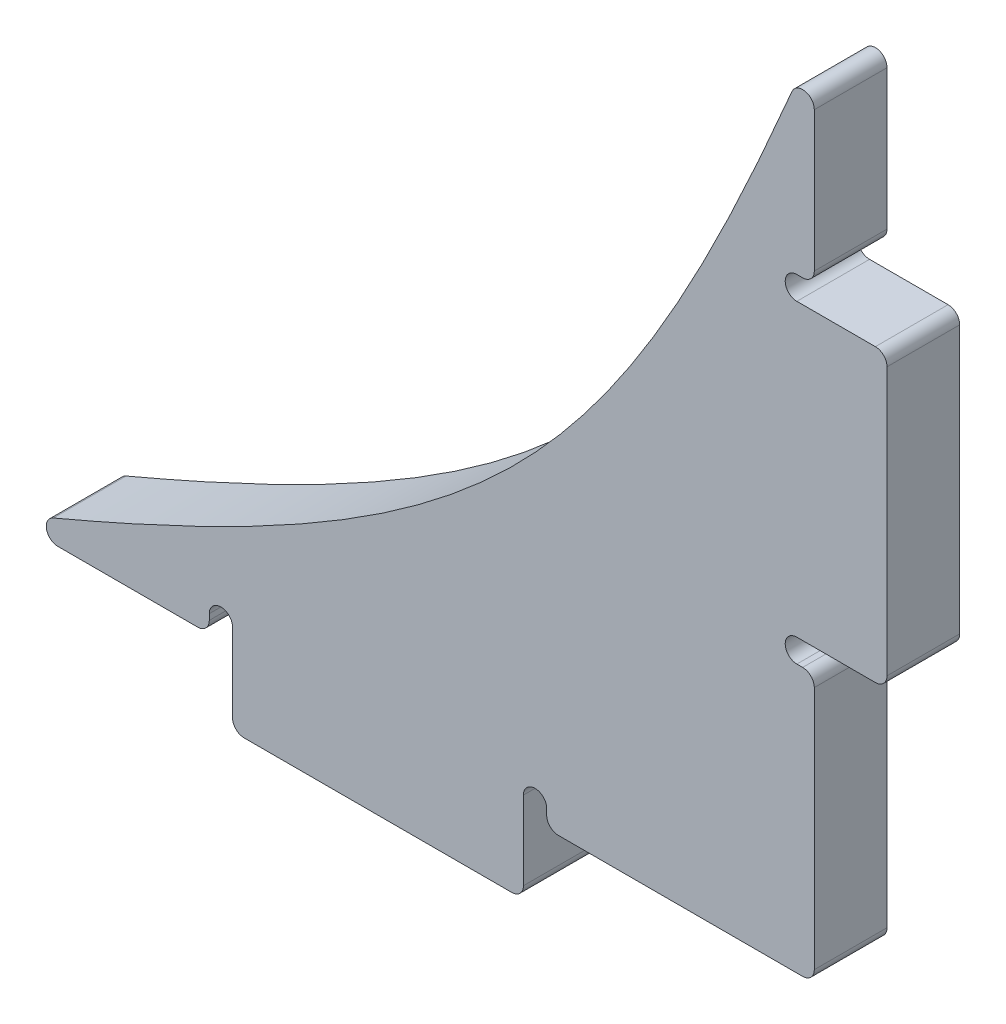
ISO-10303-21;
HEADER;
FILE_DESCRIPTION(('STEP AP214'),'2;1');
FILE_NAME('part.step','',(''),(''),'','','');
FILE_SCHEMA(('AUTOMOTIVE_DESIGN { 1 0 10303 214 1 1 1 1 }'));
ENDSEC;
DATA;
#1=APPLICATION_CONTEXT('core data for automotive mechanical design processes');
#2=APPLICATION_PROTOCOL_DEFINITION('international standard','automotive_design',2000,#1);
#3=PRODUCT_CONTEXT('',#1,'mechanical');
#4=PRODUCT('Part','Part','',(#3));
#5=PRODUCT_RELATED_PRODUCT_CATEGORY('part','',(#4));
#6=PRODUCT_DEFINITION_FORMATION('','',#4);
#7=PRODUCT_DEFINITION_CONTEXT('part definition',#1,'design');
#8=PRODUCT_DEFINITION('design','',#6,#7);
#9=PRODUCT_DEFINITION_SHAPE('','',#8);
#10=(LENGTH_UNIT() NAMED_UNIT(*) SI_UNIT(.MILLI.,.METRE.));
#11=(NAMED_UNIT(*) PLANE_ANGLE_UNIT() SI_UNIT($,.RADIAN.));
#12=(NAMED_UNIT(*) SI_UNIT($,.STERADIAN.) SOLID_ANGLE_UNIT());
#13=UNCERTAINTY_MEASURE_WITH_UNIT(LENGTH_MEASURE(1.E-05),#10,'distance_accuracy_value','');
#14=(GEOMETRIC_REPRESENTATION_CONTEXT(3) GLOBAL_UNCERTAINTY_ASSIGNED_CONTEXT((#13)) GLOBAL_UNIT_ASSIGNED_CONTEXT((#10,
#11,#12)) REPRESENTATION_CONTEXT('',''));
#15=CARTESIAN_POINT('',(0.,0.,0.));
#16=DIRECTION('',(0.,0.,1.));
#17=DIRECTION('',(1.,0.,0.));
#18=AXIS2_PLACEMENT_3D('',#15,#16,#17);
#19=CARTESIAN_POINT('',(16.6195398425815,-6.45990638103132,2.143125));
#20=DIRECTION('',(-1.,0.,0.));
#21=DIRECTION('',(0.,0.,1.));
#22=AXIS2_PLACEMENT_3D('',#19,#20,#21);
#23=PLANE('',#22);
#24=DIRECTION('',(0.,1.,0.));
#25=VECTOR('',#24,1.);
#26=CARTESIAN_POINT('',(16.6195398425815,-6.45990638103132,1.031875));
#27=LINE('',#26,#25);
#28=CARTESIAN_POINT('',(16.6195398425815,2.96349361896868,1.031875));
#29=VERTEX_POINT('',#28);
#30=CARTESIAN_POINT('',(16.6195398425815,5.09915083060559,1.031875));
#31=VERTEX_POINT('',#30);
#32=EDGE_CURVE('E377',#29,#31,#27,.T.);
#33=ORIENTED_EDGE('',*,*,#32,.T.);
#34=DIRECTION('',(0.,0.,-1.));
#35=VECTOR('',#34,1.);
#36=CARTESIAN_POINT('',(16.6195398425815,5.09915083060559,2.143125));
#37=LINE('',#36,#35);
#38=CARTESIAN_POINT('',(16.6195398425815,5.09915083060559,2.143125));
#39=VERTEX_POINT('',#38);
#40=EDGE_CURVE('E492',#31,#39,#37,.F.);
#41=ORIENTED_EDGE('',*,*,#40,.T.);
#42=DIRECTION('',(0.,1.,0.));
#43=VECTOR('',#42,1.);
#44=CARTESIAN_POINT('',(16.6195398425815,-6.45990638103132,2.143125));
#45=LINE('',#44,#43);
#46=CARTESIAN_POINT('',(16.6195398425815,2.96349361896868,2.143125));
#47=VERTEX_POINT('',#46);
#48=EDGE_CURVE('E383',#47,#39,#45,.T.);
#49=ORIENTED_EDGE('',*,*,#48,.F.);
#50=DIRECTION('',(0.,0.,1.));
#51=VECTOR('',#50,1.);
#52=CARTESIAN_POINT('',(16.6195398425815,2.96349361896868,2.143125));
#53=LINE('',#52,#51);
#54=EDGE_CURVE('E489',#47,#29,#53,.F.);
#55=ORIENTED_EDGE('',*,*,#54,.T.);
#56=EDGE_LOOP('',(#33,#41,#49,#55));
#57=FACE_BOUND('',#56,.T.);
#58=ADVANCED_FACE('F38',(#57),#23,.F.);
#59=CARTESIAN_POINT('',(16.6195398425815,-6.28210638103132,1.031875));
#60=VERTEX_POINT('',#59);
#61=CARTESIAN_POINT('',(16.6195398425815,-2.54830638103132,1.031875));
#62=VERTEX_POINT('',#61);
#63=EDGE_CURVE('E607',#60,#62,#27,.T.);
#64=ORIENTED_EDGE('',*,*,#63,.T.);
#65=DIRECTION('',(0.,0.,1.));
#66=VECTOR('',#65,1.);
#67=CARTESIAN_POINT('',(16.6195398425815,-2.54830638103132,2.143125));
#68=LINE('',#67,#66);
#69=CARTESIAN_POINT('',(16.6195398425815,-2.54830638103132,2.143125));
#70=VERTEX_POINT('',#69);
#71=EDGE_CURVE('E549',#62,#70,#68,.T.);
#72=ORIENTED_EDGE('',*,*,#71,.T.);
#73=CARTESIAN_POINT('',(16.6195398425815,-6.28210638103132,2.143125));
#74=VERTEX_POINT('',#73);
#75=EDGE_CURVE('E378',#74,#70,#45,.T.);
#76=ORIENTED_EDGE('',*,*,#75,.F.);
#77=DIRECTION('',(0.,0.,-1.));
#78=VECTOR('',#77,1.);
#79=CARTESIAN_POINT('',(16.6195398425815,-6.28210638103132,2.143125));
#80=LINE('',#79,#78);
#81=EDGE_CURVE('E545',#74,#60,#80,.T.);
#82=ORIENTED_EDGE('',*,*,#81,.T.);
#83=EDGE_LOOP('',(#64,#72,#76,#82));
#84=FACE_BOUND('',#83,.T.);
#85=ADVANCED_FACE('F408',(#84),#23,.F.);
#86=CARTESIAN_POINT('',(16.6195398425815,-6.45990638103132,2.143125));
#87=DIRECTION('',(0.,1.,0.));
#88=DIRECTION('',(-1.,0.,0.));
#89=AXIS2_PLACEMENT_3D('',#86,#87,#88);
#90=PLANE('',#89);
#91=DIRECTION('',(1.,0.,0.));
#92=VECTOR('',#91,1.);
#93=CARTESIAN_POINT('',(16.6195398425815,-6.45990638103132,1.031875));
#94=LINE('',#93,#92);
#95=CARTESIAN_POINT('',(5.06048263094462,-6.45990638103132,1.031875));
#96=VERTEX_POINT('',#95);
#97=CARTESIAN_POINT('',(7.19613984258153,-6.45990638103132,1.031875));
#98=VERTEX_POINT('',#97);
#99=EDGE_CURVE('E587',#96,#98,#94,.T.);
#100=ORIENTED_EDGE('',*,*,#99,.T.);
#101=DIRECTION('',(0.,0.,1.));
#102=VECTOR('',#101,1.);
#103=CARTESIAN_POINT('',(7.19613984258153,-6.45990638103132,2.143125));
#104=LINE('',#103,#102);
#105=CARTESIAN_POINT('',(7.19613984258153,-6.45990638103132,2.143125));
#106=VERTEX_POINT('',#105);
#107=EDGE_CURVE('E47',#98,#106,#104,.T.);
#108=ORIENTED_EDGE('',*,*,#107,.T.);
#109=DIRECTION('',(1.,0.,0.));
#110=VECTOR('',#109,1.);
#111=CARTESIAN_POINT('',(16.6195398425815,-6.45990638103132,2.143125));
#112=LINE('',#111,#110);
#113=CARTESIAN_POINT('',(5.06048263094462,-6.45990638103132,2.143125));
#114=VERTEX_POINT('',#113);
#115=EDGE_CURVE('E391',#114,#106,#112,.T.);
#116=ORIENTED_EDGE('',*,*,#115,.F.);
#117=DIRECTION('',(0.,0.,-1.));
#118=VECTOR('',#117,1.);
#119=CARTESIAN_POINT('',(5.06048263094462,-6.45990638103132,2.143125));
#120=LINE('',#119,#118);
#121=EDGE_CURVE('E580',#114,#96,#120,.T.);
#122=ORIENTED_EDGE('',*,*,#121,.T.);
#123=EDGE_LOOP('',(#100,#108,#116,#122));
#124=FACE_BOUND('',#123,.T.);
#125=ADVANCED_FACE('F404',(#124),#90,.F.);
#126=CARTESIAN_POINT('',(12.7079398425815,-6.45990638103132,1.031875));
#127=VERTEX_POINT('',#126);
#128=CARTESIAN_POINT('',(16.4417398425815,-6.45990638103132,1.031875));
#129=VERTEX_POINT('',#128);
#130=EDGE_CURVE('E618',#127,#129,#94,.T.);
#131=ORIENTED_EDGE('',*,*,#130,.T.);
#132=DIRECTION('',(0.,0.,-1.));
#133=VECTOR('',#132,1.);
#134=CARTESIAN_POINT('',(16.4417398425815,-6.45990638103132,2.143125));
#135=LINE('',#134,#133);
#136=CARTESIAN_POINT('',(16.4417398425815,-6.45990638103132,2.143125));
#137=VERTEX_POINT('',#136);
#138=EDGE_CURVE('E559',#129,#137,#135,.F.);
#139=ORIENTED_EDGE('',*,*,#138,.T.);
#140=CARTESIAN_POINT('',(12.7079398425815,-6.45990638103132,2.143125));
#141=VERTEX_POINT('',#140);
#142=EDGE_CURVE('E390',#141,#137,#112,.T.);
#143=ORIENTED_EDGE('',*,*,#142,.F.);
#144=DIRECTION('',(0.,0.,1.));
#145=VECTOR('',#144,1.);
#146=CARTESIAN_POINT('',(12.7079398425815,-6.45990638103132,2.143125));
#147=LINE('',#146,#145);
#148=EDGE_CURVE('E556',#141,#127,#147,.F.);
#149=ORIENTED_EDGE('',*,*,#148,.T.);
#150=EDGE_LOOP('',(#131,#139,#143,#149));
#151=FACE_BOUND('',#150,.T.);
#152=ADVANCED_FACE('F402',(#151),#90,.F.);
#153=CARTESIAN_POINT('',(16.6195398425815,5.98609361896868,2.143125));
#154=CARTESIAN_POINT('',(13.5396294849557,-1.494142237981,2.143125));
#155=CARTESIAN_POINT('',(11.6537756995312,-3.37999602340552,2.143125));
#156=CARTESIAN_POINT('',(4.17353984258153,-6.45990638103132,2.143125));
#157=B_SPLINE_CURVE_WITH_KNOTS('',3,(#153,#154,#155,#156),.UNSPECIFIED.,.F.,.F.,(4,4),(0.,1.),.UNSPECIFIED.);
#158=DIRECTION('',(0.,0.,-1.));
#159=VECTOR('',#158,1.);
#160=SURFACE_OF_LINEAR_EXTRUSION('',#157,#159);
#161=CARTESIAN_POINT('',(16.2780630966552,5.16859694527703,2.143125));
#162=VERTEX_POINT('',#161);
#163=CARTESIAN_POINT('',(4.99103651627317,-6.11842963510496,2.143125));
#164=VERTEX_POINT('',#163);
#165=EDGE_CURVE('E382',#162,#164,#157,.T.);
#166=ORIENTED_EDGE('',*,*,#165,.F.);
#167=DIRECTION('',(0.,0.,-1.));
#168=VECTOR('',#167,1.);
#169=CARTESIAN_POINT('',(16.2780630966552,5.16859694527703,2.143125));
#170=LINE('',#169,#168);
#171=CARTESIAN_POINT('',(16.2780630966552,5.16859694527703,1.031875));
#172=VERTEX_POINT('',#171);
#173=EDGE_CURVE('E462',#162,#172,#170,.T.);
#174=ORIENTED_EDGE('',*,*,#173,.T.);
#175=CARTESIAN_POINT('',(16.6195398425815,5.98609361896868,1.031875));
#176=CARTESIAN_POINT('',(13.5396294849557,-1.494142237981,1.031875));
#177=CARTESIAN_POINT('',(11.6537756995312,-3.37999602340552,1.031875));
#178=CARTESIAN_POINT('',(4.17353984258153,-6.45990638103132,1.031875));
#179=B_SPLINE_CURVE_WITH_KNOTS('',3,(#175,#176,#177,#178),.UNSPECIFIED.,.F.,.F.,(4,4),(0.,1.),.UNSPECIFIED.);
#180=CARTESIAN_POINT('',(4.99103651627317,-6.11842963510496,1.031875));
#181=VERTEX_POINT('',#180);
#182=EDGE_CURVE('E614',#172,#181,#179,.T.);
#183=ORIENTED_EDGE('',*,*,#182,.T.);
#184=DIRECTION('',(0.,0.,-1.));
#185=VECTOR('',#184,1.);
#186=CARTESIAN_POINT('',(4.99103651627318,-6.11842963510496,1.031875));
#187=LINE('',#186,#185);
#188=EDGE_CURVE('E591',#181,#164,#187,.F.);
#189=ORIENTED_EDGE('',*,*,#188,.T.);
#190=EDGE_LOOP('',(#166,#174,#183,#189));
#191=FACE_BOUND('',#190,.T.);
#192=ADVANCED_FACE('F397',(#191),#160,.F.);
#193=CARTESIAN_POINT('',(12.046661904828,-1.88702844327778,2.143125));
#194=DIRECTION('',(0.,0.,1.));
#195=DIRECTION('',(1.,0.,0.));
#196=AXIS2_PLACEMENT_3D('',#193,#194,#195);
#197=PLANE('',#196);
#198=ORIENTED_EDGE('',*,*,#48,.T.);
#199=CARTESIAN_POINT('',(16.4417398425815,5.09915083060559,2.143125));
#200=DIRECTION('',(0.,0.,1.));
#201=DIRECTION('',(1.,0.,0.));
#202=AXIS2_PLACEMENT_3D('',#199,#200,#201);
#203=CIRCLE('',#202,0.1778);
#204=EDGE_CURVE('E524',#39,#162,#203,.T.);
#205=ORIENTED_EDGE('',*,*,#204,.T.);
#206=ORIENTED_EDGE('',*,*,#165,.T.);
#207=CARTESIAN_POINT('',(5.06048263094462,-6.28210638103132,2.143125));
#208=DIRECTION('',(0.,0.,1.));
#209=DIRECTION('',(1.,0.,0.));
#210=AXIS2_PLACEMENT_3D('',#207,#208,#209);
#211=CIRCLE('',#210,0.1778);
#212=EDGE_CURVE('E495',#164,#114,#211,.T.);
#213=ORIENTED_EDGE('',*,*,#212,.T.);
#214=ORIENTED_EDGE('',*,*,#115,.T.);
#215=CARTESIAN_POINT('',(7.19613984258153,-6.28210638103132,2.143125));
#216=DIRECTION('',(0.,0.,1.));
#217=DIRECTION('',(1.,0.,0.));
#218=AXIS2_PLACEMENT_3D('',#215,#216,#217);
#219=CIRCLE('',#218,0.1778);
#220=CARTESIAN_POINT('',(7.37393984258153,-6.28210638103132,2.143125));
#221=VERTEX_POINT('',#220);
#222=EDGE_CURVE('E54',#106,#221,#219,.T.);
#223=ORIENTED_EDGE('',*,*,#222,.T.);
#224=DIRECTION('',(0.,-1.,0.));
#225=VECTOR('',#224,1.);
#226=CARTESIAN_POINT('',(7.37393984258153,-6.19320638103132,2.143125));
#227=LINE('',#226,#225);
#228=CARTESIAN_POINT('',(7.37393984258153,-6.19320638103132,2.143125));
#229=VERTEX_POINT('',#228);
#230=EDGE_CURVE('E255',#229,#221,#227,.T.);
#231=ORIENTED_EDGE('',*,*,#230,.F.);
#232=CARTESIAN_POINT('',(7.55173984258153,-6.19320638103132,2.143125));
#233=DIRECTION('',(0.,0.,1.));
#234=DIRECTION('',(1.,0.,0.));
#235=AXIS2_PLACEMENT_3D('',#232,#233,#234);
#236=CIRCLE('',#235,0.1778);
#237=CARTESIAN_POINT('',(7.72953984258153,-6.19320638103132,2.143125));
#238=VERTEX_POINT('',#237);
#239=EDGE_CURVE('E253',#238,#229,#236,.T.);
#240=ORIENTED_EDGE('',*,*,#239,.F.);
#241=DIRECTION('',(0.,1.,0.));
#242=VECTOR('',#241,1.);
#243=CARTESIAN_POINT('',(7.72953984258153,-7.57115638103132,2.143125));
#244=LINE('',#243,#242);
#245=CARTESIAN_POINT('',(7.72953984258153,-7.39335638103132,2.143125));
#246=VERTEX_POINT('',#245);
#247=EDGE_CURVE('E366',#246,#238,#244,.T.);
#248=ORIENTED_EDGE('',*,*,#247,.F.);
#249=CARTESIAN_POINT('',(7.90733984258153,-7.39335638103132,2.143125));
#250=DIRECTION('',(0.,0.,1.));
#251=DIRECTION('',(1.,0.,0.));
#252=AXIS2_PLACEMENT_3D('',#249,#250,#251);
#253=CIRCLE('',#252,0.1778);
#254=CARTESIAN_POINT('',(7.90733984258153,-7.57115638103132,2.143125));
#255=VERTEX_POINT('',#254);
#256=EDGE_CURVE('E500',#246,#255,#253,.T.);
#257=ORIENTED_EDGE('',*,*,#256,.T.);
#258=DIRECTION('',(-1.,0.,0.));
#259=VECTOR('',#258,1.);
#260=CARTESIAN_POINT('',(7.72953984258153,-7.57115638103132,2.143125));
#261=LINE('',#260,#259);
#262=CARTESIAN_POINT('',(11.9967398425815,-7.57115638103132,2.143125));
#263=VERTEX_POINT('',#262);
#264=EDGE_CURVE('E362',#263,#255,#261,.T.);
#265=ORIENTED_EDGE('',*,*,#264,.F.);
#266=CARTESIAN_POINT('',(11.9967398425815,-7.39335638103132,2.143125));
#267=DIRECTION('',(0.,0.,1.));
#268=DIRECTION('',(1.,0.,0.));
#269=AXIS2_PLACEMENT_3D('',#266,#267,#268);
#270=CIRCLE('',#269,0.1778);
#271=CARTESIAN_POINT('',(12.1745398425815,-7.39335638103132,2.143125));
#272=VERTEX_POINT('',#271);
#273=EDGE_CURVE('E503',#263,#272,#270,.T.);
#274=ORIENTED_EDGE('',*,*,#273,.T.);
#275=DIRECTION('',(0.,1.,0.));
#276=VECTOR('',#275,1.);
#277=CARTESIAN_POINT('',(12.1745398425815,-7.57115638103132,2.143125));
#278=LINE('',#277,#276);
#279=CARTESIAN_POINT('',(12.1745398425815,-6.19320638103132,2.143125));
#280=VERTEX_POINT('',#279);
#281=EDGE_CURVE('E369',#272,#280,#278,.T.);
#282=ORIENTED_EDGE('',*,*,#281,.T.);
#283=CARTESIAN_POINT('',(12.3523398425815,-6.19320638103132,2.143125));
#284=DIRECTION('',(0.,0.,1.));
#285=DIRECTION('',(1.,0.,0.));
#286=AXIS2_PLACEMENT_3D('',#283,#284,#285);
#287=CIRCLE('',#286,0.1778);
#288=CARTESIAN_POINT('',(12.5301398425815,-6.19320638103132,2.143125));
#289=VERTEX_POINT('',#288);
#290=EDGE_CURVE('E285',#289,#280,#287,.T.);
#291=ORIENTED_EDGE('',*,*,#290,.F.);
#292=DIRECTION('',(0.,1.,0.));
#293=VECTOR('',#292,1.);
#294=CARTESIAN_POINT('',(12.5301398425815,-6.45990638103132,2.143125));
#295=LINE('',#294,#293);
#296=CARTESIAN_POINT('',(12.5301398425815,-6.28210638103132,2.143125));
#297=VERTEX_POINT('',#296);
#298=EDGE_CURVE('E289',#297,#289,#295,.T.);
#299=ORIENTED_EDGE('',*,*,#298,.F.);
#300=CARTESIAN_POINT('',(12.7079398425815,-6.28210638103132,2.143125));
#301=DIRECTION('',(0.,0.,1.));
#302=DIRECTION('',(1.,0.,0.));
#303=AXIS2_PLACEMENT_3D('',#300,#301,#302);
#304=CIRCLE('',#303,0.1778);
#305=EDGE_CURVE('E506',#297,#141,#304,.T.);
#306=ORIENTED_EDGE('',*,*,#305,.T.);
#307=ORIENTED_EDGE('',*,*,#142,.T.);
#308=CARTESIAN_POINT('',(16.4417398425815,-6.28210638103132,2.143125));
#309=DIRECTION('',(0.,0.,1.));
#310=DIRECTION('',(1.,0.,0.));
#311=AXIS2_PLACEMENT_3D('',#308,#309,#310);
#312=CIRCLE('',#311,0.1778);
#313=EDGE_CURVE('E509',#137,#74,#312,.T.);
#314=ORIENTED_EDGE('',*,*,#313,.T.);
#315=ORIENTED_EDGE('',*,*,#75,.T.);
#316=CARTESIAN_POINT('',(16.4417398425815,-2.54830638103132,2.143125));
#317=DIRECTION('',(0.,0.,1.));
#318=DIRECTION('',(1.,0.,0.));
#319=AXIS2_PLACEMENT_3D('',#316,#317,#318);
#320=CIRCLE('',#319,0.1778);
#321=CARTESIAN_POINT('',(16.4417398425815,-2.37050638103132,2.143125));
#322=VERTEX_POINT('',#321);
#323=EDGE_CURVE('E512',#70,#322,#320,.T.);
#324=ORIENTED_EDGE('',*,*,#323,.T.);
#325=DIRECTION('',(1.,0.,0.));
#326=VECTOR('',#325,1.);
#327=CARTESIAN_POINT('',(16.3528398425815,-2.37050638103132,2.143125));
#328=LINE('',#327,#326);
#329=CARTESIAN_POINT('',(16.3528398425815,-2.37050638103132,2.143125));
#330=VERTEX_POINT('',#329);
#331=EDGE_CURVE('E304',#330,#322,#328,.T.);
#332=ORIENTED_EDGE('',*,*,#331,.F.);
#333=CARTESIAN_POINT('',(16.3528398425815,-2.19270638103132,2.143125));
#334=DIRECTION('',(0.,0.,1.));
#335=DIRECTION('',(1.,0.,0.));
#336=AXIS2_PLACEMENT_3D('',#333,#334,#335);
#337=CIRCLE('',#336,0.177799999999999);
#338=CARTESIAN_POINT('',(16.3528398425815,-2.01490638103132,2.143125));
#339=VERTEX_POINT('',#338);
#340=EDGE_CURVE('E299',#339,#330,#337,.T.);
#341=ORIENTED_EDGE('',*,*,#340,.F.);
#342=DIRECTION('',(-1.,0.,0.));
#343=VECTOR('',#342,1.);
#344=CARTESIAN_POINT('',(17.7307898425815,-2.01490638103132,2.143125));
#345=LINE('',#344,#343);
#346=CARTESIAN_POINT('',(17.5529898425815,-2.01490638103132,2.143125));
#347=VERTEX_POINT('',#346);
#348=EDGE_CURVE('E355',#347,#339,#345,.T.);
#349=ORIENTED_EDGE('',*,*,#348,.F.);
#350=CARTESIAN_POINT('',(17.5529898425815,-1.83710638103132,2.143125));
#351=DIRECTION('',(0.,0.,1.));
#352=DIRECTION('',(1.,0.,0.));
#353=AXIS2_PLACEMENT_3D('',#350,#351,#352);
#354=CIRCLE('',#353,0.1778);
#355=CARTESIAN_POINT('',(17.7307898425815,-1.83710638103132,2.143125));
#356=VERTEX_POINT('',#355);
#357=EDGE_CURVE('E515',#347,#356,#354,.T.);
#358=ORIENTED_EDGE('',*,*,#357,.T.);
#359=DIRECTION('',(0.,-1.,0.));
#360=VECTOR('',#359,1.);
#361=CARTESIAN_POINT('',(17.7307898425815,-2.01490638103132,2.143125));
#362=LINE('',#361,#360);
#363=CARTESIAN_POINT('',(17.7307898425815,2.25229361896868,2.143125));
#364=VERTEX_POINT('',#363);
#365=EDGE_CURVE('E244',#364,#356,#362,.T.);
#366=ORIENTED_EDGE('',*,*,#365,.F.);
#367=CARTESIAN_POINT('',(17.5529898425815,2.25229361896868,2.143125));
#368=DIRECTION('',(0.,0.,1.));
#369=DIRECTION('',(1.,0.,0.));
#370=AXIS2_PLACEMENT_3D('',#367,#368,#369);
#371=CIRCLE('',#370,0.1778);
#372=CARTESIAN_POINT('',(17.5529898425815,2.43009361896868,2.143125));
#373=VERTEX_POINT('',#372);
#374=EDGE_CURVE('E518',#364,#373,#371,.T.);
#375=ORIENTED_EDGE('',*,*,#374,.T.);
#376=DIRECTION('',(-1.,0.,0.));
#377=VECTOR('',#376,1.);
#378=CARTESIAN_POINT('',(17.7307898425815,2.43009361896868,2.143125));
#379=LINE('',#378,#377);
#380=CARTESIAN_POINT('',(16.3528398425815,2.43009361896868,2.143125));
#381=VERTEX_POINT('',#380);
#382=EDGE_CURVE('E346',#373,#381,#379,.T.);
#383=ORIENTED_EDGE('',*,*,#382,.T.);
#384=CARTESIAN_POINT('',(16.3528398425815,2.60789361896868,2.143125));
#385=DIRECTION('',(0.,0.,1.));
#386=DIRECTION('',(1.,0.,0.));
#387=AXIS2_PLACEMENT_3D('',#384,#385,#386);
#388=CIRCLE('',#387,0.177800000000001);
#389=CARTESIAN_POINT('',(16.3528398425815,2.78569361896868,2.143125));
#390=VERTEX_POINT('',#389);
#391=EDGE_CURVE('E325',#390,#381,#388,.T.);
#392=ORIENTED_EDGE('',*,*,#391,.F.);
#393=DIRECTION('',(-1.,0.,0.));
#394=VECTOR('',#393,1.);
#395=CARTESIAN_POINT('',(16.6195398425815,2.78569361896868,2.143125));
#396=LINE('',#395,#394);
#397=CARTESIAN_POINT('',(16.4417398425815,2.78569361896868,2.143125));
#398=VERTEX_POINT('',#397);
#399=EDGE_CURVE('E329',#398,#390,#396,.T.);
#400=ORIENTED_EDGE('',*,*,#399,.F.);
#401=CARTESIAN_POINT('',(16.4417398425815,2.96349361896868,2.143125));
#402=DIRECTION('',(0.,0.,1.));
#403=DIRECTION('',(1.,0.,0.));
#404=AXIS2_PLACEMENT_3D('',#401,#402,#403);
#405=CIRCLE('',#404,0.1778);
#406=EDGE_CURVE('E521',#398,#47,#405,.T.);
#407=ORIENTED_EDGE('',*,*,#406,.T.);
#408=EDGE_LOOP('',(#198,#205,#206,#213,#214,#223,#231,#240,#248,#257,#265,#274,#282,#291,#299,
#306,#307,#314,#315,#324,#332,#341,#349,#358,#366,#375,#383,#392,#400,#407));
#409=FACE_BOUND('',#408,.T.);
#410=ADVANCED_FACE('F401',(#409),#197,.T.);
#411=CARTESIAN_POINT('',(12.046661904828,-1.88702844327778,1.031875));
#412=DIRECTION('',(0.,0.,1.));
#413=DIRECTION('',(1.,0.,0.));
#414=AXIS2_PLACEMENT_3D('',#411,#412,#413);
#415=PLANE('',#414);
#416=ORIENTED_EDGE('',*,*,#182,.F.);
#417=CARTESIAN_POINT('',(16.4417398425815,5.09915083060559,1.031875));
#418=DIRECTION('',(0.,0.,1.));
#419=DIRECTION('',(1.,0.,0.));
#420=AXIS2_PLACEMENT_3D('',#417,#418,#419);
#421=CIRCLE('',#420,0.1778);
#422=EDGE_CURVE('E486',#172,#31,#421,.F.);
#423=ORIENTED_EDGE('',*,*,#422,.T.);
#424=ORIENTED_EDGE('',*,*,#32,.F.);
#425=CARTESIAN_POINT('',(16.4417398425815,2.96349361896868,1.031875));
#426=DIRECTION('',(0.,0.,1.));
#427=DIRECTION('',(1.,0.,0.));
#428=AXIS2_PLACEMENT_3D('',#425,#426,#427);
#429=CIRCLE('',#428,0.1778);
#430=CARTESIAN_POINT('',(16.4417398425815,2.78569361896868,1.031875));
#431=VERTEX_POINT('',#430);
#432=EDGE_CURVE('E483',#29,#431,#429,.F.);
#433=ORIENTED_EDGE('',*,*,#432,.T.);
#434=DIRECTION('',(1.,0.,0.));
#435=VECTOR('',#434,1.);
#436=CARTESIAN_POINT('',(16.6195398425815,2.78569361896868,1.031875));
#437=LINE('',#436,#435);
#438=CARTESIAN_POINT('',(16.3528398425815,2.78569361896868,1.031875));
#439=VERTEX_POINT('',#438);
#440=EDGE_CURVE('E321',#439,#431,#437,.T.);
#441=ORIENTED_EDGE('',*,*,#440,.F.);
#442=CARTESIAN_POINT('',(16.3528398425815,2.60789361896868,1.031875));
#443=DIRECTION('',(0.,0.,1.));
#444=DIRECTION('',(1.,0.,0.));
#445=AXIS2_PLACEMENT_3D('',#442,#443,#444);
#446=CIRCLE('',#445,0.177800000000001);
#447=CARTESIAN_POINT('',(16.3528398425815,2.43009361896868,1.031875));
#448=VERTEX_POINT('',#447);
#449=EDGE_CURVE('E317',#448,#439,#446,.F.);
#450=ORIENTED_EDGE('',*,*,#449,.F.);
#451=DIRECTION('',(-1.,0.,0.));
#452=VECTOR('',#451,1.);
#453=CARTESIAN_POINT('',(17.7307898425815,2.43009361896868,1.031875));
#454=LINE('',#453,#452);
#455=CARTESIAN_POINT('',(17.5529898425815,2.43009361896868,1.031875));
#456=VERTEX_POINT('',#455);
#457=EDGE_CURVE('E349',#456,#448,#454,.T.);
#458=ORIENTED_EDGE('',*,*,#457,.F.);
#459=CARTESIAN_POINT('',(17.5529898425815,2.25229361896868,1.031875));
#460=DIRECTION('',(0.,0.,1.));
#461=DIRECTION('',(1.,0.,0.));
#462=AXIS2_PLACEMENT_3D('',#459,#460,#461);
#463=CIRCLE('',#462,0.1778);
#464=CARTESIAN_POINT('',(17.7307898425815,2.25229361896868,1.031875));
#465=VERTEX_POINT('',#464);
#466=EDGE_CURVE('E480',#456,#465,#463,.F.);
#467=ORIENTED_EDGE('',*,*,#466,.T.);
#468=DIRECTION('',(0.,1.,0.));
#469=VECTOR('',#468,1.);
#470=CARTESIAN_POINT('',(17.7307898425815,-2.01490638103132,1.031875));
#471=LINE('',#470,#469);
#472=CARTESIAN_POINT('',(17.7307898425815,-1.83710638103132,1.031875));
#473=VERTEX_POINT('',#472);
#474=EDGE_CURVE('E342',#473,#465,#471,.T.);
#475=ORIENTED_EDGE('',*,*,#474,.F.);
#476=CARTESIAN_POINT('',(17.5529898425815,-1.83710638103132,1.031875));
#477=DIRECTION('',(0.,0.,1.));
#478=DIRECTION('',(1.,0.,0.));
#479=AXIS2_PLACEMENT_3D('',#476,#477,#478);
#480=CIRCLE('',#479,0.1778);
#481=CARTESIAN_POINT('',(17.5529898425815,-2.01490638103132,1.031875));
#482=VERTEX_POINT('',#481);
#483=EDGE_CURVE('E477',#473,#482,#480,.F.);
#484=ORIENTED_EDGE('',*,*,#483,.T.);
#485=DIRECTION('',(-1.,0.,0.));
#486=VECTOR('',#485,1.);
#487=CARTESIAN_POINT('',(17.7307898425815,-2.01490638103132,1.031875));
#488=LINE('',#487,#486);
#489=CARTESIAN_POINT('',(16.3528398425815,-2.01490638103132,1.031875));
#490=VERTEX_POINT('',#489);
#491=EDGE_CURVE('E352',#482,#490,#488,.T.);
#492=ORIENTED_EDGE('',*,*,#491,.T.);
#493=CARTESIAN_POINT('',(16.3528398425815,-2.19270638103132,1.031875));
#494=DIRECTION('',(0.,0.,1.));
#495=DIRECTION('',(1.,0.,0.));
#496=AXIS2_PLACEMENT_3D('',#493,#494,#495);
#497=CIRCLE('',#496,0.177799999999999);
#498=CARTESIAN_POINT('',(16.3528398425815,-2.37050638103132,1.031875));
#499=VERTEX_POINT('',#498);
#500=EDGE_CURVE('E295',#499,#490,#497,.F.);
#501=ORIENTED_EDGE('',*,*,#500,.F.);
#502=DIRECTION('',(-1.,0.,0.));
#503=VECTOR('',#502,1.);
#504=CARTESIAN_POINT('',(16.3528398425815,-2.37050638103132,1.031875));
#505=LINE('',#504,#503);
#506=CARTESIAN_POINT('',(16.4417398425815,-2.37050638103132,1.031875));
#507=VERTEX_POINT('',#506);
#508=EDGE_CURVE('E281',#507,#499,#505,.T.);
#509=ORIENTED_EDGE('',*,*,#508,.F.);
#510=CARTESIAN_POINT('',(16.4417398425815,-2.54830638103132,1.031875));
#511=DIRECTION('',(0.,0.,1.));
#512=DIRECTION('',(1.,0.,0.));
#513=AXIS2_PLACEMENT_3D('',#510,#511,#512);
#514=CIRCLE('',#513,0.1778);
#515=EDGE_CURVE('E474',#507,#62,#514,.F.);
#516=ORIENTED_EDGE('',*,*,#515,.T.);
#517=ORIENTED_EDGE('',*,*,#63,.F.);
#518=CARTESIAN_POINT('',(16.4417398425815,-6.28210638103132,1.031875));
#519=DIRECTION('',(0.,0.,1.));
#520=DIRECTION('',(1.,0.,0.));
#521=AXIS2_PLACEMENT_3D('',#518,#519,#520);
#522=CIRCLE('',#521,0.1778);
#523=EDGE_CURVE('E471',#60,#129,#522,.F.);
#524=ORIENTED_EDGE('',*,*,#523,.T.);
#525=ORIENTED_EDGE('',*,*,#130,.F.);
#526=CARTESIAN_POINT('',(12.7079398425815,-6.28210638103132,1.031875));
#527=DIRECTION('',(0.,0.,1.));
#528=DIRECTION('',(1.,0.,0.));
#529=AXIS2_PLACEMENT_3D('',#526,#527,#528);
#530=CIRCLE('',#529,0.1778);
#531=CARTESIAN_POINT('',(12.5301398425815,-6.28210638103132,1.031875));
#532=VERTEX_POINT('',#531);
#533=EDGE_CURVE('E468',#127,#532,#530,.F.);
#534=ORIENTED_EDGE('',*,*,#533,.T.);
#535=DIRECTION('',(0.,-1.,0.));
#536=VECTOR('',#535,1.);
#537=CARTESIAN_POINT('',(12.5301398425815,-6.45990638103132,1.031875));
#538=LINE('',#537,#536);
#539=CARTESIAN_POINT('',(12.5301398425815,-6.19320638103132,1.031875));
#540=VERTEX_POINT('',#539);
#541=EDGE_CURVE('E280',#540,#532,#538,.T.);
#542=ORIENTED_EDGE('',*,*,#541,.F.);
#543=CARTESIAN_POINT('',(12.3523398425815,-6.19320638103132,1.031875));
#544=DIRECTION('',(0.,0.,1.));
#545=DIRECTION('',(1.,0.,0.));
#546=AXIS2_PLACEMENT_3D('',#543,#544,#545);
#547=CIRCLE('',#546,0.1778);
#548=CARTESIAN_POINT('',(12.1745398425815,-6.19320638103132,1.031875));
#549=VERTEX_POINT('',#548);
#550=EDGE_CURVE('E276',#549,#540,#547,.F.);
#551=ORIENTED_EDGE('',*,*,#550,.F.);
#552=DIRECTION('',(0.,1.,0.));
#553=VECTOR('',#552,1.);
#554=CARTESIAN_POINT('',(12.1745398425815,-7.57115638103132,1.031875));
#555=LINE('',#554,#553);
#556=CARTESIAN_POINT('',(12.1745398425815,-7.39335638103132,1.031875));
#557=VERTEX_POINT('',#556);
#558=EDGE_CURVE('E372',#557,#549,#555,.T.);
#559=ORIENTED_EDGE('',*,*,#558,.F.);
#560=CARTESIAN_POINT('',(11.9967398425815,-7.39335638103132,1.031875));
#561=DIRECTION('',(0.,0.,1.));
#562=DIRECTION('',(1.,0.,0.));
#563=AXIS2_PLACEMENT_3D('',#560,#561,#562);
#564=CIRCLE('',#563,0.1778);
#565=CARTESIAN_POINT('',(11.9967398425815,-7.57115638103132,1.031875));
#566=VERTEX_POINT('',#565);
#567=EDGE_CURVE('E460',#557,#566,#564,.F.);
#568=ORIENTED_EDGE('',*,*,#567,.T.);
#569=DIRECTION('',(1.,0.,0.));
#570=VECTOR('',#569,1.);
#571=CARTESIAN_POINT('',(7.72953984258153,-7.57115638103132,1.031875));
#572=LINE('',#571,#570);
#573=CARTESIAN_POINT('',(7.90733984258153,-7.57115638103132,1.031875));
#574=VERTEX_POINT('',#573);
#575=EDGE_CURVE('E358',#574,#566,#572,.T.);
#576=ORIENTED_EDGE('',*,*,#575,.F.);
#577=CARTESIAN_POINT('',(7.90733984258153,-7.39335638103132,1.031875));
#578=DIRECTION('',(0.,0.,1.));
#579=DIRECTION('',(1.,0.,0.));
#580=AXIS2_PLACEMENT_3D('',#577,#578,#579);
#581=CIRCLE('',#580,0.1778);
#582=CARTESIAN_POINT('',(7.72953984258153,-7.39335638103132,1.031875));
#583=VERTEX_POINT('',#582);
#584=EDGE_CURVE('E455',#574,#583,#581,.F.);
#585=ORIENTED_EDGE('',*,*,#584,.T.);
#586=DIRECTION('',(0.,1.,0.));
#587=VECTOR('',#586,1.);
#588=CARTESIAN_POINT('',(7.72953984258153,-7.57115638103132,1.031875));
#589=LINE('',#588,#587);
#590=CARTESIAN_POINT('',(7.72953984258153,-6.19320638103132,1.031875));
#591=VERTEX_POINT('',#590);
#592=EDGE_CURVE('E260',#583,#591,#589,.T.);
#593=ORIENTED_EDGE('',*,*,#592,.T.);
#594=CARTESIAN_POINT('',(7.55173984258153,-6.19320638103132,1.031875));
#595=DIRECTION('',(0.,0.,1.));
#596=DIRECTION('',(1.,0.,0.));
#597=AXIS2_PLACEMENT_3D('',#594,#595,#596);
#598=CIRCLE('',#597,0.1778);
#599=CARTESIAN_POINT('',(7.37393984258153,-6.19320638103132,1.031875));
#600=VERTEX_POINT('',#599);
#601=EDGE_CURVE('E251',#600,#591,#598,.F.);
#602=ORIENTED_EDGE('',*,*,#601,.F.);
#603=DIRECTION('',(0.,1.,0.));
#604=VECTOR('',#603,1.);
#605=CARTESIAN_POINT('',(7.37393984258153,-6.19320638103132,1.031875));
#606=LINE('',#605,#604);
#607=CARTESIAN_POINT('',(7.37393984258153,-6.28210638103132,1.031875));
#608=VERTEX_POINT('',#607);
#609=EDGE_CURVE('E235',#608,#600,#606,.T.);
#610=ORIENTED_EDGE('',*,*,#609,.F.);
#611=CARTESIAN_POINT('',(7.19613984258153,-6.28210638103132,1.031875));
#612=DIRECTION('',(0.,0.,1.));
#613=DIRECTION('',(1.,0.,0.));
#614=AXIS2_PLACEMENT_3D('',#611,#612,#613);
#615=CIRCLE('',#614,0.1778);
#616=EDGE_CURVE('E451',#608,#98,#615,.F.);
#617=ORIENTED_EDGE('',*,*,#616,.T.);
#618=ORIENTED_EDGE('',*,*,#99,.F.);
#619=CARTESIAN_POINT('',(5.06048263094462,-6.28210638103132,1.031875));
#620=DIRECTION('',(0.,0.,1.));
#621=DIRECTION('',(1.,0.,0.));
#622=AXIS2_PLACEMENT_3D('',#619,#620,#621);
#623=CIRCLE('',#622,0.1778);
#624=EDGE_CURVE('E456',#96,#181,#623,.F.);
#625=ORIENTED_EDGE('',*,*,#624,.T.);
#626=EDGE_LOOP('',(#416,#423,#424,#433,#441,#450,#458,#467,#475,#484,#492,#501,#509,#516,#517,
#524,#525,#534,#542,#551,#559,#568,#576,#585,#593,#602,#610,#617,#618,#625));
#627=FACE_BOUND('',#626,.T.);
#628=ADVANCED_FACE('F258',(#627),#415,.F.);
#629=CARTESIAN_POINT('',(7.72953984258153,-7.57115638103132,2.143125));
#630=DIRECTION('',(1.,0.,0.));
#631=DIRECTION('',(0.,1.,0.));
#632=AXIS2_PLACEMENT_3D('',#629,#630,#631);
#633=PLANE('',#632);
#634=ORIENTED_EDGE('',*,*,#592,.F.);
#635=DIRECTION('',(0.,0.,-1.));
#636=VECTOR('',#635,1.);
#637=CARTESIAN_POINT('',(7.72953984258153,-7.39335638103132,2.143125));
#638=LINE('',#637,#636);
#639=EDGE_CURVE('E577',#583,#246,#638,.F.);
#640=ORIENTED_EDGE('',*,*,#639,.T.);
#641=ORIENTED_EDGE('',*,*,#247,.T.);
#642=DIRECTION('',(0.,0.,1.));
#643=VECTOR('',#642,1.);
#644=CARTESIAN_POINT('',(7.72953984258153,-6.19320638103132,1.031525));
#645=LINE('',#644,#643);
#646=EDGE_CURVE('E245',#591,#238,#645,.T.);
#647=ORIENTED_EDGE('',*,*,#646,.F.);
#648=EDGE_LOOP('',(#634,#640,#641,#647));
#649=FACE_BOUND('',#648,.T.);
#650=ADVANCED_FACE('F707',(#649),#633,.F.);
#651=CARTESIAN_POINT('',(12.1745398425815,-7.57115638103132,2.143125));
#652=DIRECTION('',(-1.,0.,0.));
#653=DIRECTION('',(0.,-1.,0.));
#654=AXIS2_PLACEMENT_3D('',#651,#652,#653);
#655=PLANE('',#654);
#656=ORIENTED_EDGE('',*,*,#281,.F.);
#657=DIRECTION('',(0.,0.,1.));
#658=VECTOR('',#657,1.);
#659=CARTESIAN_POINT('',(12.1745398425815,-7.39335638103132,1.031875));
#660=LINE('',#659,#658);
#661=EDGE_CURVE('E574',#272,#557,#660,.F.);
#662=ORIENTED_EDGE('',*,*,#661,.T.);
#663=ORIENTED_EDGE('',*,*,#558,.T.);
#664=DIRECTION('',(0.,0.,1.));
#665=VECTOR('',#664,1.);
#666=CARTESIAN_POINT('',(12.1745398425815,-6.19320638103132,1.031525));
#667=LINE('',#666,#665);
#668=EDGE_CURVE('E269',#549,#280,#667,.T.);
#669=ORIENTED_EDGE('',*,*,#668,.T.);
#670=EDGE_LOOP('',(#656,#662,#663,#669));
#671=FACE_BOUND('',#670,.T.);
#672=ADVANCED_FACE('F703',(#671),#655,.F.);
#673=CARTESIAN_POINT('',(8.61853984258153,-7.57115638103132,1.031875));
#674=DIRECTION('',(0.,-1.,0.));
#675=DIRECTION('',(0.,0.,-1.));
#676=AXIS2_PLACEMENT_3D('',#673,#674,#675);
#677=PLANE('',#676);
#678=ORIENTED_EDGE('',*,*,#575,.T.);
#679=DIRECTION('',(0.,0.,1.));
#680=VECTOR('',#679,1.);
#681=CARTESIAN_POINT('',(11.9967398425815,-7.57115638103132,2.143125));
#682=LINE('',#681,#680);
#683=EDGE_CURVE('E570',#566,#263,#682,.T.);
#684=ORIENTED_EDGE('',*,*,#683,.T.);
#685=ORIENTED_EDGE('',*,*,#264,.T.);
#686=DIRECTION('',(0.,0.,-1.));
#687=VECTOR('',#686,1.);
#688=CARTESIAN_POINT('',(7.90733984258153,-7.57115638103132,1.031875));
#689=LINE('',#688,#687);
#690=EDGE_CURVE('E566',#255,#574,#689,.T.);
#691=ORIENTED_EDGE('',*,*,#690,.T.);
#692=EDGE_LOOP('',(#678,#684,#685,#691));
#693=FACE_BOUND('',#692,.T.);
#694=ADVANCED_FACE('F700',(#693),#677,.T.);
#695=CARTESIAN_POINT('',(17.7307898425815,-2.01490638103132,2.143125));
#696=DIRECTION('',(0.,1.,0.));
#697=DIRECTION('',(0.,0.,1.));
#698=AXIS2_PLACEMENT_3D('',#695,#696,#697);
#699=PLANE('',#698);
#700=ORIENTED_EDGE('',*,*,#491,.F.);
#701=DIRECTION('',(0.,0.,-1.));
#702=VECTOR('',#701,1.);
#703=CARTESIAN_POINT('',(17.5529898425815,-2.01490638103132,2.143125));
#704=LINE('',#703,#702);
#705=EDGE_CURVE('E542',#482,#347,#704,.F.);
#706=ORIENTED_EDGE('',*,*,#705,.T.);
#707=ORIENTED_EDGE('',*,*,#348,.T.);
#708=DIRECTION('',(0.,0.,1.));
#709=VECTOR('',#708,1.);
#710=CARTESIAN_POINT('',(16.3528398425815,-2.01490638103132,1.031525));
#711=LINE('',#710,#709);
#712=EDGE_CURVE('E309',#490,#339,#711,.T.);
#713=ORIENTED_EDGE('',*,*,#712,.F.);
#714=EDGE_LOOP('',(#700,#706,#707,#713));
#715=FACE_BOUND('',#714,.T.);
#716=ADVANCED_FACE('F668',(#715),#699,.F.);
#717=CARTESIAN_POINT('',(17.7307898425815,2.43009361896868,2.143125));
#718=DIRECTION('',(0.,-1.,0.));
#719=DIRECTION('',(0.,0.,-1.));
#720=AXIS2_PLACEMENT_3D('',#717,#718,#719);
#721=PLANE('',#720);
#722=ORIENTED_EDGE('',*,*,#382,.F.);
#723=DIRECTION('',(0.,0.,1.));
#724=VECTOR('',#723,1.);
#725=CARTESIAN_POINT('',(17.5529898425815,2.43009361896868,2.143125));
#726=LINE('',#725,#724);
#727=EDGE_CURVE('E539',#373,#456,#726,.F.);
#728=ORIENTED_EDGE('',*,*,#727,.T.);
#729=ORIENTED_EDGE('',*,*,#457,.T.);
#730=DIRECTION('',(0.,0.,1.));
#731=VECTOR('',#730,1.);
#732=CARTESIAN_POINT('',(16.3528398425815,2.43009361896868,1.031525));
#733=LINE('',#732,#731);
#734=EDGE_CURVE('E332',#448,#381,#733,.T.);
#735=ORIENTED_EDGE('',*,*,#734,.T.);
#736=EDGE_LOOP('',(#722,#728,#729,#735));
#737=FACE_BOUND('',#736,.T.);
#738=ADVANCED_FACE('F695',(#737),#721,.F.);
#739=CARTESIAN_POINT('',(17.7307898425815,-2.01490638103132,1.031875));
#740=DIRECTION('',(-1.,0.,0.));
#741=DIRECTION('',(0.,0.,1.));
#742=AXIS2_PLACEMENT_3D('',#739,#740,#741);
#743=PLANE('',#742);
#744=ORIENTED_EDGE('',*,*,#474,.T.);
#745=DIRECTION('',(0.,0.,1.));
#746=VECTOR('',#745,1.);
#747=CARTESIAN_POINT('',(17.7307898425815,2.25229361896868,1.031875));
#748=LINE('',#747,#746);
#749=EDGE_CURVE('E535',#465,#364,#748,.T.);
#750=ORIENTED_EDGE('',*,*,#749,.T.);
#751=ORIENTED_EDGE('',*,*,#365,.T.);
#752=DIRECTION('',(0.,0.,-1.));
#753=VECTOR('',#752,1.);
#754=CARTESIAN_POINT('',(17.7307898425815,-1.83710638103132,1.031875));
#755=LINE('',#754,#753);
#756=EDGE_CURVE('E531',#356,#473,#755,.T.);
#757=ORIENTED_EDGE('',*,*,#756,.T.);
#758=EDGE_LOOP('',(#744,#750,#751,#757));
#759=FACE_BOUND('',#758,.T.);
#760=ADVANCED_FACE('F658',(#759),#743,.F.);
#761=CARTESIAN_POINT('',(16.3528398425815,2.60789361896868,1.031525));
#762=DIRECTION('',(0.,0.,1.));
#763=DIRECTION('',(1.,0.,0.));
#764=AXIS2_PLACEMENT_3D('',#761,#762,#763);
#765=CYLINDRICAL_SURFACE('',#764,0.177800000000001);
#766=ORIENTED_EDGE('',*,*,#449,.T.);
#767=DIRECTION('',(0.,0.,1.));
#768=VECTOR('',#767,1.);
#769=CARTESIAN_POINT('',(16.3528398425815,2.78569361896868,1.031525));
#770=LINE('',#769,#768);
#771=EDGE_CURVE('E300',#439,#390,#770,.T.);
#772=ORIENTED_EDGE('',*,*,#771,.T.);
#773=ORIENTED_EDGE('',*,*,#391,.T.);
#774=ORIENTED_EDGE('',*,*,#734,.F.);
#775=EDGE_LOOP('',(#766,#772,#773,#774));
#776=FACE_BOUND('',#775,.T.);
#777=ADVANCED_FACE('F648',(#776),#765,.F.);
#778=CARTESIAN_POINT('',(16.6195398425815,2.78569361896868,1.031525));
#779=DIRECTION('',(0.,1.,0.));
#780=DIRECTION('',(-1.,0.,0.));
#781=AXIS2_PLACEMENT_3D('',#778,#779,#780);
#782=PLANE('',#781);
#783=ORIENTED_EDGE('',*,*,#440,.T.);
#784=DIRECTION('',(0.,0.,1.));
#785=VECTOR('',#784,1.);
#786=CARTESIAN_POINT('',(16.4417398425815,2.78569361896868,1.031525));
#787=LINE('',#786,#785);
#788=EDGE_CURVE('E527',#431,#398,#787,.T.);
#789=ORIENTED_EDGE('',*,*,#788,.T.);
#790=ORIENTED_EDGE('',*,*,#399,.T.);
#791=ORIENTED_EDGE('',*,*,#771,.F.);
#792=EDGE_LOOP('',(#783,#789,#790,#791));
#793=FACE_BOUND('',#792,.T.);
#794=ADVANCED_FACE('F643',(#793),#782,.F.);
#795=CARTESIAN_POINT('',(16.3528398425815,-2.19270638103132,1.031525));
#796=DIRECTION('',(0.,0.,1.));
#797=DIRECTION('',(1.,0.,0.));
#798=AXIS2_PLACEMENT_3D('',#795,#796,#797);
#799=CYLINDRICAL_SURFACE('',#798,0.177799999999999);
#800=ORIENTED_EDGE('',*,*,#500,.T.);
#801=ORIENTED_EDGE('',*,*,#712,.T.);
#802=ORIENTED_EDGE('',*,*,#340,.T.);
#803=DIRECTION('',(0.,0.,1.));
#804=VECTOR('',#803,1.);
#805=CARTESIAN_POINT('',(16.3528398425815,-2.37050638103132,1.031525));
#806=LINE('',#805,#804);
#807=EDGE_CURVE('E308',#499,#330,#806,.T.);
#808=ORIENTED_EDGE('',*,*,#807,.F.);
#809=EDGE_LOOP('',(#800,#801,#802,#808));
#810=FACE_BOUND('',#809,.T.);
#811=ADVANCED_FACE('F671',(#810),#799,.F.);
#812=CARTESIAN_POINT('',(16.3528398425815,-2.37050638103132,1.031525));
#813=DIRECTION('',(0.,-1.,0.));
#814=DIRECTION('',(1.,0.,0.));
#815=AXIS2_PLACEMENT_3D('',#812,#813,#814);
#816=PLANE('',#815);
#817=ORIENTED_EDGE('',*,*,#331,.T.);
#818=DIRECTION('',(0.,0.,1.));
#819=VECTOR('',#818,1.);
#820=CARTESIAN_POINT('',(16.4417398425815,-2.37050638103132,1.031525));
#821=LINE('',#820,#819);
#822=EDGE_CURVE('E553',#322,#507,#821,.F.);
#823=ORIENTED_EDGE('',*,*,#822,.T.);
#824=ORIENTED_EDGE('',*,*,#508,.T.);
#825=ORIENTED_EDGE('',*,*,#807,.T.);
#826=EDGE_LOOP('',(#817,#823,#824,#825));
#827=FACE_BOUND('',#826,.T.);
#828=ADVANCED_FACE('F675',(#827),#816,.F.);
#829=CARTESIAN_POINT('',(12.3523398425815,-6.19320638103132,1.031525));
#830=DIRECTION('',(0.,0.,1.));
#831=DIRECTION('',(1.,0.,0.));
#832=AXIS2_PLACEMENT_3D('',#829,#830,#831);
#833=CYLINDRICAL_SURFACE('',#832,0.1778);
#834=ORIENTED_EDGE('',*,*,#550,.T.);
#835=DIRECTION('',(0.,0.,1.));
#836=VECTOR('',#835,1.);
#837=CARTESIAN_POINT('',(12.5301398425815,-6.19320638103132,1.031525));
#838=LINE('',#837,#836);
#839=EDGE_CURVE('E263',#540,#289,#838,.T.);
#840=ORIENTED_EDGE('',*,*,#839,.T.);
#841=ORIENTED_EDGE('',*,*,#290,.T.);
#842=ORIENTED_EDGE('',*,*,#668,.F.);
#843=EDGE_LOOP('',(#834,#840,#841,#842));
#844=FACE_BOUND('',#843,.T.);
#845=ADVANCED_FACE('F677',(#844),#833,.F.);
#846=CARTESIAN_POINT('',(12.5301398425815,-6.45990638103132,1.031525));
#847=DIRECTION('',(1.,0.,0.));
#848=DIRECTION('',(0.,0.,-1.));
#849=AXIS2_PLACEMENT_3D('',#846,#847,#848);
#850=PLANE('',#849);
#851=ORIENTED_EDGE('',*,*,#541,.T.);
#852=DIRECTION('',(0.,0.,1.));
#853=VECTOR('',#852,1.);
#854=CARTESIAN_POINT('',(12.5301398425815,-6.28210638103132,1.031525));
#855=LINE('',#854,#853);
#856=EDGE_CURVE('E562',#532,#297,#855,.T.);
#857=ORIENTED_EDGE('',*,*,#856,.T.);
#858=ORIENTED_EDGE('',*,*,#298,.T.);
#859=ORIENTED_EDGE('',*,*,#839,.F.);
#860=EDGE_LOOP('',(#851,#857,#858,#859));
#861=FACE_BOUND('',#860,.T.);
#862=ADVANCED_FACE('F683',(#861),#850,.F.);
#863=CARTESIAN_POINT('',(7.55173984258153,-6.19320638103132,1.031525));
#864=DIRECTION('',(0.,0.,1.));
#865=DIRECTION('',(1.,0.,0.));
#866=AXIS2_PLACEMENT_3D('',#863,#864,#865);
#867=CYLINDRICAL_SURFACE('',#866,0.1778);
#868=ORIENTED_EDGE('',*,*,#601,.T.);
#869=ORIENTED_EDGE('',*,*,#646,.T.);
#870=ORIENTED_EDGE('',*,*,#239,.T.);
#871=DIRECTION('',(0.,0.,1.));
#872=VECTOR('',#871,1.);
#873=CARTESIAN_POINT('',(7.37393984258153,-6.19320638103132,1.031525));
#874=LINE('',#873,#872);
#875=EDGE_CURVE('E238',#600,#229,#874,.T.);
#876=ORIENTED_EDGE('',*,*,#875,.F.);
#877=EDGE_LOOP('',(#868,#869,#870,#876));
#878=FACE_BOUND('',#877,.T.);
#879=ADVANCED_FACE('F249',(#878),#867,.F.);
#880=CARTESIAN_POINT('',(7.37393984258153,-6.19320638103132,1.031525));
#881=DIRECTION('',(-1.,0.,0.));
#882=DIRECTION('',(0.,-1.,0.));
#883=AXIS2_PLACEMENT_3D('',#880,#881,#882);
#884=PLANE('',#883);
#885=ORIENTED_EDGE('',*,*,#230,.T.);
#886=DIRECTION('',(0.,0.,1.));
#887=VECTOR('',#886,1.);
#888=CARTESIAN_POINT('',(7.37393984258153,-6.28210638103132,1.031525));
#889=LINE('',#888,#887);
#890=EDGE_CURVE('E11',#221,#608,#889,.F.);
#891=ORIENTED_EDGE('',*,*,#890,.T.);
#892=ORIENTED_EDGE('',*,*,#609,.T.);
#893=ORIENTED_EDGE('',*,*,#875,.T.);
#894=EDGE_LOOP('',(#885,#891,#892,#893));
#895=FACE_BOUND('',#894,.T.);
#896=ADVANCED_FACE('F237',(#895),#884,.F.);
#897=CARTESIAN_POINT('',(16.4417398425815,5.09915083060559,1.5875));
#898=DIRECTION('',(0.,0.,-1.));
#899=DIRECTION('',(-1.,0.,0.));
#900=AXIS2_PLACEMENT_3D('',#897,#898,#899);
#901=CYLINDRICAL_SURFACE('',#900,0.1778);
#902=ORIENTED_EDGE('',*,*,#204,.F.);
#903=ORIENTED_EDGE('',*,*,#40,.F.);
#904=ORIENTED_EDGE('',*,*,#422,.F.);
#905=ORIENTED_EDGE('',*,*,#173,.F.);
#906=EDGE_LOOP('',(#902,#903,#904,#905));
#907=FACE_BOUND('',#906,.T.);
#908=ADVANCED_FACE('F410',(#907),#901,.T.);
#909=CARTESIAN_POINT('',(16.4417398425815,2.96349361896868,1.031525));
#910=DIRECTION('',(0.,0.,1.));
#911=DIRECTION('',(1.,0.,0.));
#912=AXIS2_PLACEMENT_3D('',#909,#910,#911);
#913=CYLINDRICAL_SURFACE('',#912,0.1778);
#914=ORIENTED_EDGE('',*,*,#432,.F.);
#915=ORIENTED_EDGE('',*,*,#54,.F.);
#916=ORIENTED_EDGE('',*,*,#406,.F.);
#917=ORIENTED_EDGE('',*,*,#788,.F.);
#918=EDGE_LOOP('',(#914,#915,#916,#917));
#919=FACE_BOUND('',#918,.T.);
#920=ADVANCED_FACE('F413',(#919),#913,.T.);
#921=CARTESIAN_POINT('',(17.5529898425815,2.25229361896868,1.031875));
#922=DIRECTION('',(0.,0.,1.));
#923=DIRECTION('',(1.,0.,0.));
#924=AXIS2_PLACEMENT_3D('',#921,#922,#923);
#925=CYLINDRICAL_SURFACE('',#924,0.1778);
#926=ORIENTED_EDGE('',*,*,#466,.F.);
#927=ORIENTED_EDGE('',*,*,#727,.F.);
#928=ORIENTED_EDGE('',*,*,#374,.F.);
#929=ORIENTED_EDGE('',*,*,#749,.F.);
#930=EDGE_LOOP('',(#926,#927,#928,#929));
#931=FACE_BOUND('',#930,.T.);
#932=ADVANCED_FACE('F417',(#931),#925,.T.);
#933=CARTESIAN_POINT('',(17.5529898425815,-1.83710638103132,1.031875));
#934=DIRECTION('',(0.,0.,-1.));
#935=DIRECTION('',(-1.,0.,0.));
#936=AXIS2_PLACEMENT_3D('',#933,#934,#935);
#937=CYLINDRICAL_SURFACE('',#936,0.1778);
#938=ORIENTED_EDGE('',*,*,#357,.F.);
#939=ORIENTED_EDGE('',*,*,#705,.F.);
#940=ORIENTED_EDGE('',*,*,#483,.F.);
#941=ORIENTED_EDGE('',*,*,#756,.F.);
#942=EDGE_LOOP('',(#938,#939,#940,#941));
#943=FACE_BOUND('',#942,.T.);
#944=ADVANCED_FACE('F421',(#943),#937,.T.);
#945=CARTESIAN_POINT('',(16.4417398425815,-2.54830638103132,2.143125));
#946=DIRECTION('',(0.,0.,1.));
#947=DIRECTION('',(1.,0.,0.));
#948=AXIS2_PLACEMENT_3D('',#945,#946,#947);
#949=CYLINDRICAL_SURFACE('',#948,0.1778);
#950=ORIENTED_EDGE('',*,*,#515,.F.);
#951=ORIENTED_EDGE('',*,*,#822,.F.);
#952=ORIENTED_EDGE('',*,*,#323,.F.);
#953=ORIENTED_EDGE('',*,*,#71,.F.);
#954=EDGE_LOOP('',(#950,#951,#952,#953));
#955=FACE_BOUND('',#954,.T.);
#956=ADVANCED_FACE('F425',(#955),#949,.T.);
#957=CARTESIAN_POINT('',(16.4417398425815,-6.28210638103132,2.143125));
#958=DIRECTION('',(0.,0.,-1.));
#959=DIRECTION('',(-1.,0.,0.));
#960=AXIS2_PLACEMENT_3D('',#957,#958,#959);
#961=CYLINDRICAL_SURFACE('',#960,0.1778);
#962=ORIENTED_EDGE('',*,*,#313,.F.);
#963=ORIENTED_EDGE('',*,*,#138,.F.);
#964=ORIENTED_EDGE('',*,*,#523,.F.);
#965=ORIENTED_EDGE('',*,*,#81,.F.);
#966=EDGE_LOOP('',(#962,#963,#964,#965));
#967=FACE_BOUND('',#966,.T.);
#968=ADVANCED_FACE('F429',(#967),#961,.T.);
#969=CARTESIAN_POINT('',(12.7079398425815,-6.28210638103132,1.031525));
#970=DIRECTION('',(0.,0.,1.));
#971=DIRECTION('',(1.,0.,0.));
#972=AXIS2_PLACEMENT_3D('',#969,#970,#971);
#973=CYLINDRICAL_SURFACE('',#972,0.1778);
#974=ORIENTED_EDGE('',*,*,#533,.F.);
#975=ORIENTED_EDGE('',*,*,#148,.F.);
#976=ORIENTED_EDGE('',*,*,#305,.F.);
#977=ORIENTED_EDGE('',*,*,#856,.F.);
#978=EDGE_LOOP('',(#974,#975,#976,#977));
#979=FACE_BOUND('',#978,.T.);
#980=ADVANCED_FACE('F433',(#979),#973,.T.);
#981=CARTESIAN_POINT('',(11.9967398425815,-7.39335638103132,1.031875));
#982=DIRECTION('',(0.,0.,-1.));
#983=DIRECTION('',(-1.,0.,0.));
#984=AXIS2_PLACEMENT_3D('',#981,#982,#983);
#985=CYLINDRICAL_SURFACE('',#984,0.1778);
#986=ORIENTED_EDGE('',*,*,#567,.F.);
#987=ORIENTED_EDGE('',*,*,#661,.F.);
#988=ORIENTED_EDGE('',*,*,#273,.F.);
#989=ORIENTED_EDGE('',*,*,#683,.F.);
#990=EDGE_LOOP('',(#986,#987,#988,#989));
#991=FACE_BOUND('',#990,.T.);
#992=ADVANCED_FACE('F437',(#991),#985,.T.);
#993=CARTESIAN_POINT('',(7.90733984258153,-7.39335638103132,1.031875));
#994=DIRECTION('',(0.,0.,1.));
#995=DIRECTION('',(1.,0.,0.));
#996=AXIS2_PLACEMENT_3D('',#993,#994,#995);
#997=CYLINDRICAL_SURFACE('',#996,0.1778);
#998=ORIENTED_EDGE('',*,*,#256,.F.);
#999=ORIENTED_EDGE('',*,*,#639,.F.);
#1000=ORIENTED_EDGE('',*,*,#584,.F.);
#1001=ORIENTED_EDGE('',*,*,#690,.F.);
#1002=EDGE_LOOP('',(#998,#999,#1000,#1001));
#1003=FACE_BOUND('',#1002,.T.);
#1004=ADVANCED_FACE('F441',(#1003),#997,.T.);
#1005=CARTESIAN_POINT('',(7.19613984258153,-6.28210638103132,2.143125));
#1006=DIRECTION('',(0.,0.,1.));
#1007=DIRECTION('',(1.,0.,0.));
#1008=AXIS2_PLACEMENT_3D('',#1005,#1006,#1007);
#1009=CYLINDRICAL_SURFACE('',#1008,0.1778);
#1010=ORIENTED_EDGE('',*,*,#616,.F.);
#1011=ORIENTED_EDGE('',*,*,#890,.F.);
#1012=ORIENTED_EDGE('',*,*,#222,.F.);
#1013=ORIENTED_EDGE('',*,*,#107,.F.);
#1014=EDGE_LOOP('',(#1010,#1011,#1012,#1013));
#1015=FACE_BOUND('',#1014,.T.);
#1016=ADVANCED_FACE('F444',(#1015),#1009,.T.);
#1017=CARTESIAN_POINT('',(5.06048263094462,-6.28210638103132,1.5875));
#1018=DIRECTION('',(0.,0.,-1.));
#1019=DIRECTION('',(-1.,0.,0.));
#1020=AXIS2_PLACEMENT_3D('',#1017,#1018,#1019);
#1021=CYLINDRICAL_SURFACE('',#1020,0.1778);
#1022=ORIENTED_EDGE('',*,*,#212,.F.);
#1023=ORIENTED_EDGE('',*,*,#188,.F.);
#1024=ORIENTED_EDGE('',*,*,#624,.F.);
#1025=ORIENTED_EDGE('',*,*,#121,.F.);
#1026=EDGE_LOOP('',(#1022,#1023,#1024,#1025));
#1027=FACE_BOUND('',#1026,.T.);
#1028=ADVANCED_FACE('F40',(#1027),#1021,.T.);
#1029=CLOSED_SHELL('',(#58,#85,#125,#152,#192,#410,#628,#650,#672,#694,#716,#738,#760,#777,#794,
#811,#828,#845,#862,#879,#896,#908,#920,#932,#944,#956,#968,#980,#992,#1004,#1016,#1028));
#1030=MANIFOLD_SOLID_BREP('B2',#1029);
#1031=ADVANCED_BREP_SHAPE_REPRESENTATION('',(#18,#1030),#14);
#1032=SHAPE_DEFINITION_REPRESENTATION(#9,#1031);
ENDSEC;
END-ISO-10303-21;
